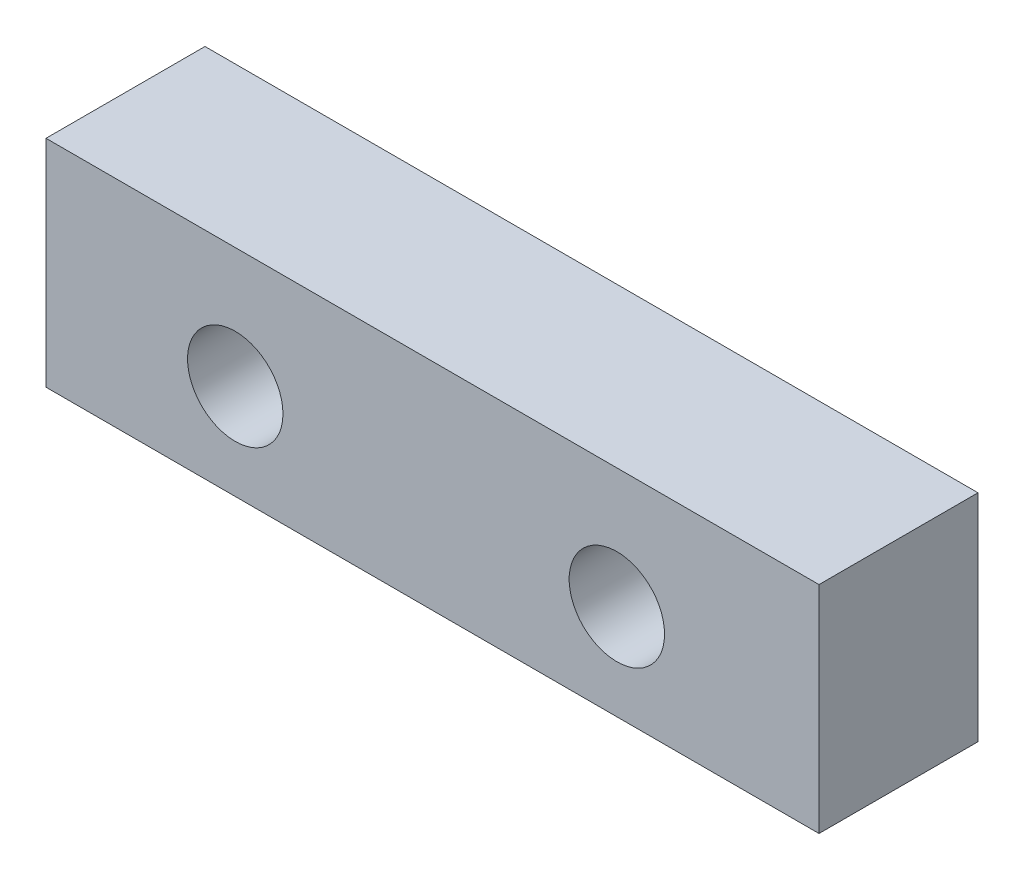
ISO-10303-21;
HEADER;
FILE_DESCRIPTION(('STEP AP214'),'2;1');
FILE_NAME('part.step','',(''),(''),'','','');
FILE_SCHEMA(('AUTOMOTIVE_DESIGN { 1 0 10303 214 1 1 1 1 }'));
ENDSEC;
DATA;
#1=APPLICATION_CONTEXT('core data for automotive mechanical design processes');
#2=APPLICATION_PROTOCOL_DEFINITION('international standard','automotive_design',2000,#1);
#3=PRODUCT_CONTEXT('',#1,'mechanical');
#4=PRODUCT('Part','Part','',(#3));
#5=PRODUCT_RELATED_PRODUCT_CATEGORY('part','',(#4));
#6=PRODUCT_DEFINITION_FORMATION('','',#4);
#7=PRODUCT_DEFINITION_CONTEXT('part definition',#1,'design');
#8=PRODUCT_DEFINITION('design','',#6,#7);
#9=PRODUCT_DEFINITION_SHAPE('','',#8);
#10=(LENGTH_UNIT() NAMED_UNIT(*) SI_UNIT(.MILLI.,.METRE.));
#11=(NAMED_UNIT(*) PLANE_ANGLE_UNIT() SI_UNIT($,.RADIAN.));
#12=(NAMED_UNIT(*) SI_UNIT($,.STERADIAN.) SOLID_ANGLE_UNIT());
#13=UNCERTAINTY_MEASURE_WITH_UNIT(LENGTH_MEASURE(1.E-05),#10,'distance_accuracy_value','');
#14=(GEOMETRIC_REPRESENTATION_CONTEXT(3) GLOBAL_UNCERTAINTY_ASSIGNED_CONTEXT((#13)) GLOBAL_UNIT_ASSIGNED_CONTEXT((#10,
#11,#12)) REPRESENTATION_CONTEXT('',''));
#15=CARTESIAN_POINT('',(0.,0.,0.));
#16=DIRECTION('',(0.,0.,1.));
#17=DIRECTION('',(1.,0.,0.));
#18=AXIS2_PLACEMENT_3D('',#15,#16,#17);
#19=CARTESIAN_POINT('',(0.,0.,5.));
#20=DIRECTION('',(0.,0.,1.));
#21=DIRECTION('',(1.,0.,0.));
#22=AXIS2_PLACEMENT_3D('',#19,#20,#21);
#23=PLANE('',#22);
#24=CARTESIAN_POINT('',(-1.6553341149312,-1.71285374976032,5.));
#25=DIRECTION('',(0.,0.,1.));
#26=DIRECTION('',(1.,0.,0.));
#27=AXIS2_PLACEMENT_3D('',#24,#25,#26);
#28=CIRCLE('',#27,1.5);
#29=CARTESIAN_POINT('',(-0.155334114931195,-1.71285374976032,5.));
#30=VERTEX_POINT('',#29);
#31=EDGE_CURVE('E100',#30,#30,#28,.T.);
#32=ORIENTED_EDGE('',*,*,#31,.F.);
#33=EDGE_LOOP('',(#32));
#34=FACE_BOUND('',#33,.T.);
#35=DIRECTION('',(0.,-1.,0.));
#36=VECTOR('',#35,1.);
#37=CARTESIAN_POINT('',(-7.60671131819463,2.06704111907463,5.));
#38=LINE('',#37,#36);
#39=CARTESIAN_POINT('',(-7.60671131819463,2.06704111907463,5.));
#40=VERTEX_POINT('',#39);
#41=CARTESIAN_POINT('',(-7.60671131819463,-4.71285375149015,5.));
#42=VERTEX_POINT('',#41);
#43=EDGE_CURVE('E85',#40,#42,#38,.T.);
#44=ORIENTED_EDGE('',*,*,#43,.T.);
#45=DIRECTION('',(1.,0.,0.));
#46=VECTOR('',#45,1.);
#47=CARTESIAN_POINT('',(-7.60671131819463,-4.71285375149015,5.));
#48=LINE('',#47,#46);
#49=CARTESIAN_POINT('',(16.701692242123,-4.71285375149015,5.));
#50=VERTEX_POINT('',#49);
#51=EDGE_CURVE('E80',#42,#50,#48,.T.);
#52=ORIENTED_EDGE('',*,*,#51,.T.);
#53=DIRECTION('',(0.,1.,0.));
#54=VECTOR('',#53,1.);
#55=CARTESIAN_POINT('',(16.701692242123,2.06704111907463,5.));
#56=LINE('',#55,#54);
#57=CARTESIAN_POINT('',(16.701692242123,2.06704111907463,5.));
#58=VERTEX_POINT('',#57);
#59=EDGE_CURVE('E83',#50,#58,#56,.T.);
#60=ORIENTED_EDGE('',*,*,#59,.T.);
#61=DIRECTION('',(-1.,0.,0.));
#62=VECTOR('',#61,1.);
#63=CARTESIAN_POINT('',(-7.60671131819463,2.06704111907463,5.));
#64=LINE('',#63,#62);
#65=EDGE_CURVE('E50',#58,#40,#64,.T.);
#66=ORIENTED_EDGE('',*,*,#65,.T.);
#67=EDGE_LOOP('',(#44,#52,#60,#66));
#68=FACE_BOUND('',#67,.T.);
#69=CARTESIAN_POINT('',(10.3446658829065,-1.71285375781343,5.));
#70=DIRECTION('',(0.,0.,1.));
#71=DIRECTION('',(1.,0.,0.));
#72=AXIS2_PLACEMENT_3D('',#69,#70,#71);
#73=CIRCLE('',#72,1.50000000739946);
#74=CARTESIAN_POINT('',(11.8446658903059,-1.71285375781343,5.));
#75=VERTEX_POINT('',#74);
#76=EDGE_CURVE('E115',#75,#75,#73,.T.);
#77=ORIENTED_EDGE('',*,*,#76,.F.);
#78=EDGE_LOOP('',(#77));
#79=FACE_BOUND('',#78,.T.);
#80=ADVANCED_FACE('F33',(#34,#68,#79),#23,.T.);
#81=CARTESIAN_POINT('',(0.,0.,0.));
#82=DIRECTION('',(0.,0.,1.));
#83=DIRECTION('',(1.,0.,0.));
#84=AXIS2_PLACEMENT_3D('',#81,#82,#83);
#85=PLANE('',#84);
#86=DIRECTION('',(0.,-1.,0.));
#87=VECTOR('',#86,1.);
#88=CARTESIAN_POINT('',(-7.60671131819463,2.06704111907463,0.));
#89=LINE('',#88,#87);
#90=CARTESIAN_POINT('',(-7.60671131819463,2.06704111907463,0.));
#91=VERTEX_POINT('',#90);
#92=CARTESIAN_POINT('',(-7.60671131819463,-4.71285375149015,0.));
#93=VERTEX_POINT('',#92);
#94=EDGE_CURVE('E97',#91,#93,#89,.T.);
#95=ORIENTED_EDGE('',*,*,#94,.F.);
#96=DIRECTION('',(-1.,0.,0.));
#97=VECTOR('',#96,1.);
#98=CARTESIAN_POINT('',(-7.60671131819463,2.06704111907463,0.));
#99=LINE('',#98,#97);
#100=CARTESIAN_POINT('',(16.701692242123,2.06704111907463,0.));
#101=VERTEX_POINT('',#100);
#102=EDGE_CURVE('E73',#101,#91,#99,.T.);
#103=ORIENTED_EDGE('',*,*,#102,.F.);
#104=DIRECTION('',(0.,1.,0.));
#105=VECTOR('',#104,1.);
#106=CARTESIAN_POINT('',(16.701692242123,2.06704111907463,0.));
#107=LINE('',#106,#105);
#108=CARTESIAN_POINT('',(16.701692242123,-4.71285375149015,0.));
#109=VERTEX_POINT('',#108);
#110=EDGE_CURVE('E67',#109,#101,#107,.T.);
#111=ORIENTED_EDGE('',*,*,#110,.F.);
#112=DIRECTION('',(1.,0.,0.));
#113=VECTOR('',#112,1.);
#114=CARTESIAN_POINT('',(-7.60671131819463,-4.71285375149015,0.));
#115=LINE('',#114,#113);
#116=EDGE_CURVE('E89',#93,#109,#115,.T.);
#117=ORIENTED_EDGE('',*,*,#116,.F.);
#118=EDGE_LOOP('',(#95,#103,#111,#117));
#119=FACE_BOUND('',#118,.T.);
#120=CARTESIAN_POINT('',(-1.6553341149312,-1.71285374976032,0.));
#121=DIRECTION('',(0.,0.,1.));
#122=DIRECTION('',(1.,0.,0.));
#123=AXIS2_PLACEMENT_3D('',#120,#121,#122);
#124=CIRCLE('',#123,1.5);
#125=CARTESIAN_POINT('',(-0.155334114931195,-1.71285374976032,0.));
#126=VERTEX_POINT('',#125);
#127=EDGE_CURVE('E112',#126,#126,#124,.T.);
#128=ORIENTED_EDGE('',*,*,#127,.T.);
#129=EDGE_LOOP('',(#128));
#130=FACE_BOUND('',#129,.T.);
#131=CARTESIAN_POINT('',(10.3446658829065,-1.71285375781343,0.));
#132=DIRECTION('',(0.,0.,1.));
#133=DIRECTION('',(1.,0.,0.));
#134=AXIS2_PLACEMENT_3D('',#131,#132,#133);
#135=CIRCLE('',#134,1.50000000739946);
#136=CARTESIAN_POINT('',(11.8446658903059,-1.71285375781343,0.));
#137=VERTEX_POINT('',#136);
#138=EDGE_CURVE('E118',#137,#137,#135,.T.);
#139=ORIENTED_EDGE('',*,*,#138,.T.);
#140=EDGE_LOOP('',(#139));
#141=FACE_BOUND('',#140,.T.);
#142=ADVANCED_FACE('F108',(#119,#130,#141),#85,.F.);
#143=CARTESIAN_POINT('',(-7.60671131819463,2.06704111907463,5.));
#144=DIRECTION('',(1.,0.,0.));
#145=DIRECTION('',(0.,0.,-1.));
#146=AXIS2_PLACEMENT_3D('',#143,#144,#145);
#147=PLANE('',#146);
#148=ORIENTED_EDGE('',*,*,#94,.T.);
#149=DIRECTION('',(0.,0.,-1.));
#150=VECTOR('',#149,1.);
#151=CARTESIAN_POINT('',(-7.60671131819463,-4.71285375149015,5.));
#152=LINE('',#151,#150);
#153=EDGE_CURVE('E11',#42,#93,#152,.T.);
#154=ORIENTED_EDGE('',*,*,#153,.F.);
#155=ORIENTED_EDGE('',*,*,#43,.F.);
#156=DIRECTION('',(0.,0.,-1.));
#157=VECTOR('',#156,1.);
#158=CARTESIAN_POINT('',(-7.60671131819463,2.06704111907463,5.));
#159=LINE('',#158,#157);
#160=EDGE_CURVE('E93',#40,#91,#159,.T.);
#161=ORIENTED_EDGE('',*,*,#160,.T.);
#162=EDGE_LOOP('',(#148,#154,#155,#161));
#163=FACE_BOUND('',#162,.T.);
#164=ADVANCED_FACE('F35',(#163),#147,.F.);
#165=CARTESIAN_POINT('',(-7.60671131819463,-4.71285375149015,5.));
#166=DIRECTION('',(0.,1.,0.));
#167=DIRECTION('',(0.,0.,1.));
#168=AXIS2_PLACEMENT_3D('',#165,#166,#167);
#169=PLANE('',#168);
#170=ORIENTED_EDGE('',*,*,#116,.T.);
#171=DIRECTION('',(0.,0.,-1.));
#172=VECTOR('',#171,1.);
#173=CARTESIAN_POINT('',(16.701692242123,-4.71285375149015,5.));
#174=LINE('',#173,#172);
#175=EDGE_CURVE('E42',#50,#109,#174,.T.);
#176=ORIENTED_EDGE('',*,*,#175,.F.);
#177=ORIENTED_EDGE('',*,*,#51,.F.);
#178=ORIENTED_EDGE('',*,*,#153,.T.);
#179=EDGE_LOOP('',(#170,#176,#177,#178));
#180=FACE_BOUND('',#179,.T.);
#181=ADVANCED_FACE('F88',(#180),#169,.F.);
#182=CARTESIAN_POINT('',(16.701692242123,2.06704111907463,5.));
#183=DIRECTION('',(-1.,0.,0.));
#184=DIRECTION('',(0.,0.,1.));
#185=AXIS2_PLACEMENT_3D('',#182,#183,#184);
#186=PLANE('',#185);
#187=ORIENTED_EDGE('',*,*,#110,.T.);
#188=DIRECTION('',(0.,0.,-1.));
#189=VECTOR('',#188,1.);
#190=CARTESIAN_POINT('',(16.701692242123,2.06704111907463,5.));
#191=LINE('',#190,#189);
#192=EDGE_CURVE('E90',#58,#101,#191,.T.);
#193=ORIENTED_EDGE('',*,*,#192,.F.);
#194=ORIENTED_EDGE('',*,*,#59,.F.);
#195=ORIENTED_EDGE('',*,*,#175,.T.);
#196=EDGE_LOOP('',(#187,#193,#194,#195));
#197=FACE_BOUND('',#196,.T.);
#198=ADVANCED_FACE('F91',(#197),#186,.F.);
#199=CARTESIAN_POINT('',(-7.60671131819463,2.06704111907463,5.));
#200=DIRECTION('',(0.,-1.,0.));
#201=DIRECTION('',(0.,0.,-1.));
#202=AXIS2_PLACEMENT_3D('',#199,#200,#201);
#203=PLANE('',#202);
#204=ORIENTED_EDGE('',*,*,#102,.T.);
#205=ORIENTED_EDGE('',*,*,#160,.F.);
#206=ORIENTED_EDGE('',*,*,#65,.F.);
#207=ORIENTED_EDGE('',*,*,#192,.T.);
#208=EDGE_LOOP('',(#204,#205,#206,#207));
#209=FACE_BOUND('',#208,.T.);
#210=ADVANCED_FACE('F105',(#209),#203,.F.);
#211=CARTESIAN_POINT('',(-1.6553341149312,-1.71285374976032,5.));
#212=DIRECTION('',(0.,0.,-1.));
#213=DIRECTION('',(-1.,0.,0.));
#214=AXIS2_PLACEMENT_3D('',#211,#212,#213);
#215=CYLINDRICAL_SURFACE('',#214,1.5);
#216=ORIENTED_EDGE('',*,*,#31,.T.);
#217=EDGE_LOOP('',(#216));
#218=FACE_BOUND('',#217,.T.);
#219=ORIENTED_EDGE('',*,*,#127,.F.);
#220=EDGE_LOOP('',(#219));
#221=FACE_BOUND('',#220,.T.);
#222=ADVANCED_FACE('F135',(#218,#221),#215,.F.);
#223=CARTESIAN_POINT('',(10.3446658829065,-1.71285375781343,5.));
#224=DIRECTION('',(0.,0.,-1.));
#225=DIRECTION('',(-1.,0.,0.));
#226=AXIS2_PLACEMENT_3D('',#223,#224,#225);
#227=CYLINDRICAL_SURFACE('',#226,1.50000000739946);
#228=ORIENTED_EDGE('',*,*,#76,.T.);
#229=EDGE_LOOP('',(#228));
#230=FACE_BOUND('',#229,.T.);
#231=ORIENTED_EDGE('',*,*,#138,.F.);
#232=EDGE_LOOP('',(#231));
#233=FACE_BOUND('',#232,.T.);
#234=ADVANCED_FACE('F124',(#230,#233),#227,.F.);
#235=CLOSED_SHELL('',(#80,#142,#164,#181,#198,#210,#222,#234));
#236=MANIFOLD_SOLID_BREP('B2',#235);
#237=ADVANCED_BREP_SHAPE_REPRESENTATION('',(#18,#236),#14);
#238=SHAPE_DEFINITION_REPRESENTATION(#9,#237);
ENDSEC;
END-ISO-10303-21;
